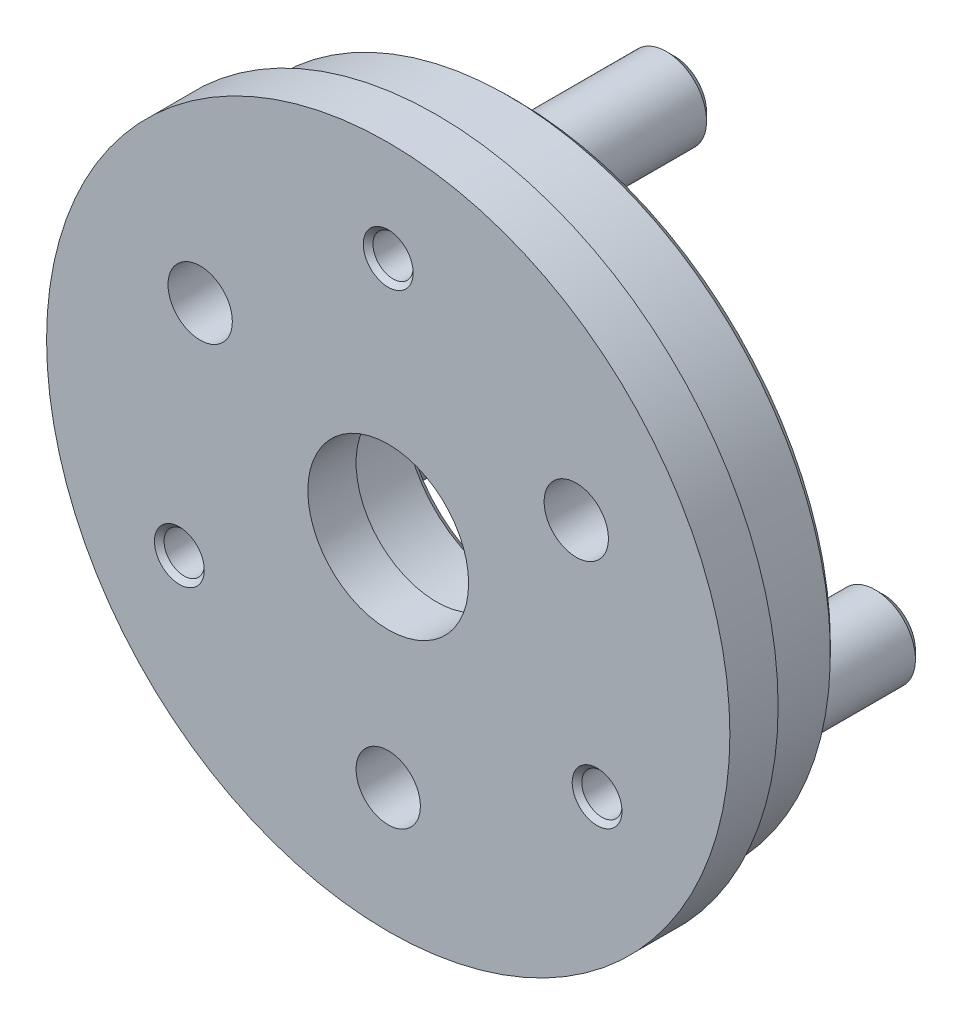
ISO-10303-21;
HEADER;
FILE_DESCRIPTION(('STEP AP214'),'2;1');
FILE_NAME('part.step','',(''),(''),'','','');
FILE_SCHEMA(('AUTOMOTIVE_DESIGN { 1 0 10303 214 1 1 1 1 }'));
ENDSEC;
DATA;
#1=APPLICATION_CONTEXT('core data for automotive mechanical design processes');
#2=APPLICATION_PROTOCOL_DEFINITION('international standard','automotive_design',2000,#1);
#3=PRODUCT_CONTEXT('',#1,'mechanical');
#4=PRODUCT('Part','Part','',(#3));
#5=PRODUCT_RELATED_PRODUCT_CATEGORY('part','',(#4));
#6=PRODUCT_DEFINITION_FORMATION('','',#4);
#7=PRODUCT_DEFINITION_CONTEXT('part definition',#1,'design');
#8=PRODUCT_DEFINITION('design','',#6,#7);
#9=PRODUCT_DEFINITION_SHAPE('','',#8);
#10=(LENGTH_UNIT() NAMED_UNIT(*) SI_UNIT(.MILLI.,.METRE.));
#11=(NAMED_UNIT(*) PLANE_ANGLE_UNIT() SI_UNIT($,.RADIAN.));
#12=(NAMED_UNIT(*) SI_UNIT($,.STERADIAN.) SOLID_ANGLE_UNIT());
#13=UNCERTAINTY_MEASURE_WITH_UNIT(LENGTH_MEASURE(1.E-05),#10,'distance_accuracy_value','');
#14=(GEOMETRIC_REPRESENTATION_CONTEXT(3) GLOBAL_UNCERTAINTY_ASSIGNED_CONTEXT((#13)) GLOBAL_UNIT_ASSIGNED_CONTEXT((#10,
#11,#12)) REPRESENTATION_CONTEXT('',''));
#15=CARTESIAN_POINT('',(0.,0.,0.));
#16=DIRECTION('',(0.,0.,1.));
#17=DIRECTION('',(1.,0.,0.));
#18=AXIS2_PLACEMENT_3D('',#15,#16,#17);
#19=CARTESIAN_POINT('',(0.,0.,-1.));
#20=DIRECTION('',(0.,0.,1.));
#21=DIRECTION('',(1.,0.,0.));
#22=AXIS2_PLACEMENT_3D('',#19,#20,#21);
#23=CYLINDRICAL_SURFACE('',#22,21.25);
#24=CARTESIAN_POINT('',(0.,0.,-2.));
#25=DIRECTION('',(0.,0.,-1.));
#26=DIRECTION('',(-1.,0.,0.));
#27=AXIS2_PLACEMENT_3D('',#24,#25,#26);
#28=CIRCLE('',#27,21.25);
#29=CARTESIAN_POINT('',(-21.25,0.,-2.));
#30=VERTEX_POINT('',#29);
#31=EDGE_CURVE('E19',#30,#30,#28,.T.);
#32=ORIENTED_EDGE('',*,*,#31,.F.);
#33=EDGE_LOOP('',(#32));
#34=FACE_BOUND('',#33,.T.);
#35=CARTESIAN_POINT('',(0.,0.,1.));
#36=DIRECTION('',(0.,0.,-1.));
#37=DIRECTION('',(-1.,0.,0.));
#38=AXIS2_PLACEMENT_3D('',#35,#36,#37);
#39=CIRCLE('',#38,21.25);
#40=CARTESIAN_POINT('',(-21.25,0.,1.));
#41=VERTEX_POINT('',#40);
#42=EDGE_CURVE('E40',#41,#41,#39,.T.);
#43=ORIENTED_EDGE('',*,*,#42,.T.);
#44=EDGE_LOOP('',(#43));
#45=FACE_BOUND('',#44,.T.);
#46=ADVANCED_FACE('F15',(#34,#45),#23,.T.);
#47=CARTESIAN_POINT('',(0.,0.,-2.));
#48=DIRECTION('',(0.,0.,-1.));
#49=DIRECTION('',(-1.,0.,0.));
#50=AXIS2_PLACEMENT_3D('',#47,#48,#49);
#51=PLANE('',#50);
#52=CARTESIAN_POINT('',(0.,0.,-2.));
#53=DIRECTION('',(0.,0.,-1.));
#54=DIRECTION('',(-1.,0.,0.));
#55=AXIS2_PLACEMENT_3D('',#52,#53,#54);
#56=CIRCLE('',#55,20.);
#57=CARTESIAN_POINT('',(-20.,0.,-2.));
#58=VERTEX_POINT('',#57);
#59=EDGE_CURVE('E31',#58,#58,#56,.T.);
#60=ORIENTED_EDGE('',*,*,#59,.F.);
#61=EDGE_LOOP('',(#60));
#62=FACE_BOUND('',#61,.T.);
#63=ORIENTED_EDGE('',*,*,#31,.T.);
#64=EDGE_LOOP('',(#63));
#65=FACE_BOUND('',#64,.T.);
#66=ADVANCED_FACE('F17',(#62,#65),#51,.T.);
#67=CARTESIAN_POINT('',(0.,0.,1.));
#68=DIRECTION('',(0.,0.,-1.));
#69=DIRECTION('',(-1.,0.,0.));
#70=AXIS2_PLACEMENT_3D('',#67,#68,#69);
#71=PLANE('',#70);
#72=CARTESIAN_POINT('',(-11.6956730781088,6.7525,1.));
#73=DIRECTION('',(0.,0.,-1.));
#74=DIRECTION('',(-1.,0.,0.));
#75=AXIS2_PLACEMENT_3D('',#72,#73,#74);
#76=CIRCLE('',#75,2.);
#77=CARTESIAN_POINT('',(-13.6956730781088,6.7525,1.));
#78=VERTEX_POINT('',#77);
#79=EDGE_CURVE('E748',#78,#78,#76,.T.);
#80=ORIENTED_EDGE('',*,*,#79,.T.);
#81=EDGE_LOOP('',(#80));
#82=FACE_BOUND('',#81,.T.);
#83=CARTESIAN_POINT('',(11.6956730781088,6.7525,1.));
#84=DIRECTION('',(0.,0.,-1.));
#85=DIRECTION('',(-1.,0.,0.));
#86=AXIS2_PLACEMENT_3D('',#83,#84,#85);
#87=CIRCLE('',#86,2.);
#88=CARTESIAN_POINT('',(9.6956730781088,6.7525,1.));
#89=VERTEX_POINT('',#88);
#90=EDGE_CURVE('E736',#89,#89,#87,.T.);
#91=ORIENTED_EDGE('',*,*,#90,.T.);
#92=EDGE_LOOP('',(#91));
#93=FACE_BOUND('',#92,.T.);
#94=CARTESIAN_POINT('',(0.,-13.505,1.));
#95=DIRECTION('',(0.,0.,-1.));
#96=DIRECTION('',(-1.,0.,0.));
#97=AXIS2_PLACEMENT_3D('',#94,#95,#96);
#98=CIRCLE('',#97,2.);
#99=CARTESIAN_POINT('',(-1.99999999999998,-13.505,1.));
#100=VERTEX_POINT('',#99);
#101=EDGE_CURVE('E725',#100,#100,#98,.T.);
#102=ORIENTED_EDGE('',*,*,#101,.T.);
#103=EDGE_LOOP('',(#102));
#104=FACE_BOUND('',#103,.T.);
#105=CARTESIAN_POINT('',(0.,15.,1.));
#106=DIRECTION('',(0.,0.,-1.));
#107=DIRECTION('',(-1.,0.,0.));
#108=AXIS2_PLACEMENT_3D('',#105,#106,#107);
#109=CIRCLE('',#108,1.55);
#110=CARTESIAN_POINT('',(-1.55,15.,1.));
#111=VERTEX_POINT('',#110);
#112=EDGE_CURVE('E78',#111,#111,#109,.T.);
#113=ORIENTED_EDGE('',*,*,#112,.T.);
#114=EDGE_LOOP('',(#113));
#115=FACE_BOUND('',#114,.T.);
#116=CARTESIAN_POINT('',(12.9903810567666,-7.5,1.));
#117=DIRECTION('',(0.,0.,-1.));
#118=DIRECTION('',(-1.,0.,0.));
#119=AXIS2_PLACEMENT_3D('',#116,#117,#118);
#120=CIRCLE('',#119,1.55);
#121=CARTESIAN_POINT('',(11.4403810567666,-7.5,1.));
#122=VERTEX_POINT('',#121);
#123=EDGE_CURVE('E75',#122,#122,#120,.T.);
#124=ORIENTED_EDGE('',*,*,#123,.T.);
#125=EDGE_LOOP('',(#124));
#126=FACE_BOUND('',#125,.T.);
#127=CARTESIAN_POINT('',(-12.9903810567666,-7.5,1.));
#128=DIRECTION('',(0.,0.,-1.));
#129=DIRECTION('',(-1.,0.,0.));
#130=AXIS2_PLACEMENT_3D('',#127,#128,#129);
#131=CIRCLE('',#130,1.55);
#132=CARTESIAN_POINT('',(-14.5403810567666,-7.5,1.));
#133=VERTEX_POINT('',#132);
#134=EDGE_CURVE('E72',#133,#133,#131,.T.);
#135=ORIENTED_EDGE('',*,*,#134,.T.);
#136=EDGE_LOOP('',(#135));
#137=FACE_BOUND('',#136,.T.);
#138=CARTESIAN_POINT('',(0.,0.,1.));
#139=DIRECTION('',(0.,0.,-1.));
#140=DIRECTION('',(-1.,0.,0.));
#141=AXIS2_PLACEMENT_3D('',#138,#139,#140);
#142=CIRCLE('',#141,5.);
#143=CARTESIAN_POINT('',(-5.,0.,1.));
#144=VERTEX_POINT('',#143);
#145=EDGE_CURVE('E44',#144,#144,#142,.T.);
#146=ORIENTED_EDGE('',*,*,#145,.T.);
#147=EDGE_LOOP('',(#146));
#148=FACE_BOUND('',#147,.T.);
#149=ORIENTED_EDGE('',*,*,#42,.F.);
#150=EDGE_LOOP('',(#149));
#151=FACE_BOUND('',#150,.T.);
#152=ADVANCED_FACE('F94',(#82,#93,#104,#115,#126,#137,#148,#151),#71,.F.);
#153=CARTESIAN_POINT('',(0.,0.,-7.));
#154=DIRECTION('',(0.,0.,1.));
#155=DIRECTION('',(1.,0.,0.));
#156=AXIS2_PLACEMENT_3D('',#153,#154,#155);
#157=CYLINDRICAL_SURFACE('',#156,20.);
#158=CARTESIAN_POINT('',(0.,0.,-6.5));
#159=DIRECTION('',(0.,0.,-1.));
#160=DIRECTION('',(-1.,0.,0.));
#161=AXIS2_PLACEMENT_3D('',#158,#159,#160);
#162=CIRCLE('',#161,20.);
#163=CARTESIAN_POINT('',(-20.,0.,-6.5));
#164=VERTEX_POINT('',#163);
#165=EDGE_CURVE('E664',#164,#164,#162,.F.);
#166=ORIENTED_EDGE('',*,*,#165,.T.);
#167=EDGE_LOOP('',(#166));
#168=FACE_BOUND('',#167,.T.);
#169=ORIENTED_EDGE('',*,*,#59,.T.);
#170=EDGE_LOOP('',(#169));
#171=FACE_BOUND('',#170,.T.);
#172=ADVANCED_FACE('F97',(#168,#171),#157,.T.);
#173=CARTESIAN_POINT('',(0.,0.,-7.));
#174=DIRECTION('',(0.,0.,-1.));
#175=DIRECTION('',(-1.,0.,0.));
#176=AXIS2_PLACEMENT_3D('',#173,#174,#175);
#177=PLANE('',#176);
#178=CARTESIAN_POINT('',(-11.6956730781088,6.7525,-7.));
#179=DIRECTION('',(0.,0.,1.));
#180=DIRECTION('',(1.,0.,0.));
#181=AXIS2_PLACEMENT_3D('',#178,#179,#180);
#182=CIRCLE('',#181,2.5);
#183=CARTESIAN_POINT('',(-9.1956730781088,6.7525,-7.));
#184=VERTEX_POINT('',#183);
#185=EDGE_CURVE('E745',#184,#184,#182,.T.);
#186=ORIENTED_EDGE('',*,*,#185,.T.);
#187=EDGE_LOOP('',(#186));
#188=FACE_BOUND('',#187,.T.);
#189=CARTESIAN_POINT('',(11.6956730781088,6.7525,-7.));
#190=DIRECTION('',(0.,0.,1.));
#191=DIRECTION('',(1.,0.,0.));
#192=AXIS2_PLACEMENT_3D('',#189,#190,#191);
#193=CIRCLE('',#192,2.5);
#194=CARTESIAN_POINT('',(14.1956730781088,6.7525,-7.));
#195=VERTEX_POINT('',#194);
#196=EDGE_CURVE('E733',#195,#195,#193,.T.);
#197=ORIENTED_EDGE('',*,*,#196,.T.);
#198=EDGE_LOOP('',(#197));
#199=FACE_BOUND('',#198,.T.);
#200=CARTESIAN_POINT('',(0.,-13.505,-7.));
#201=DIRECTION('',(0.,0.,1.));
#202=DIRECTION('',(1.,0.,0.));
#203=AXIS2_PLACEMENT_3D('',#200,#201,#202);
#204=CIRCLE('',#203,2.5);
#205=CARTESIAN_POINT('',(2.50000000000002,-13.505,-7.));
#206=VERTEX_POINT('',#205);
#207=EDGE_CURVE('E722',#206,#206,#204,.T.);
#208=ORIENTED_EDGE('',*,*,#207,.T.);
#209=EDGE_LOOP('',(#208));
#210=FACE_BOUND('',#209,.T.);
#211=CARTESIAN_POINT('',(0.,0.,-7.));
#212=DIRECTION('',(0.,0.,-1.));
#213=DIRECTION('',(-1.,0.,0.));
#214=AXIS2_PLACEMENT_3D('',#211,#212,#213);
#215=CIRCLE('',#214,19.5);
#216=CARTESIAN_POINT('',(-19.5,0.,-7.));
#217=VERTEX_POINT('',#216);
#218=EDGE_CURVE('E666',#217,#217,#215,.T.);
#219=ORIENTED_EDGE('',*,*,#218,.T.);
#220=EDGE_LOOP('',(#219));
#221=FACE_BOUND('',#220,.T.);
#222=CARTESIAN_POINT('',(0.,0.,-7.));
#223=DIRECTION('',(0.,0.,-1.));
#224=DIRECTION('',(-1.,0.,0.));
#225=AXIS2_PLACEMENT_3D('',#222,#223,#224);
#226=CIRCLE('',#225,7.);
#227=CARTESIAN_POINT('',(-7.,0.,-7.));
#228=VERTEX_POINT('',#227);
#229=EDGE_CURVE('E672',#228,#228,#226,.F.);
#230=ORIENTED_EDGE('',*,*,#229,.T.);
#231=EDGE_LOOP('',(#230));
#232=FACE_BOUND('',#231,.T.);
#233=CARTESIAN_POINT('',(12.9903810567666,-7.5,-7.));
#234=DIRECTION('',(0.,0.,-1.));
#235=DIRECTION('',(0.5,0.866025403784439,0.));
#236=AXIS2_PLACEMENT_3D('',#233,#234,#235);
#237=CIRCLE('',#236,2.5);
#238=CARTESIAN_POINT('',(14.2403810567666,-5.3349364905389,-7.));
#239=VERTEX_POINT('',#238);
#240=EDGE_CURVE('E705',#239,#239,#237,.T.);
#241=ORIENTED_EDGE('',*,*,#240,.F.);
#242=EDGE_LOOP('',(#241));
#243=FACE_BOUND('',#242,.T.);
#244=CARTESIAN_POINT('',(-12.9903810567666,-7.5,-7.));
#245=DIRECTION('',(0.,0.,-1.));
#246=DIRECTION('',(0.5,-0.866025403784437,0.));
#247=AXIS2_PLACEMENT_3D('',#244,#245,#246);
#248=CIRCLE('',#247,2.5);
#249=CARTESIAN_POINT('',(-11.7403810567666,-9.66506350946109,-7.));
#250=VERTEX_POINT('',#249);
#251=EDGE_CURVE('E37',#250,#250,#248,.T.);
#252=ORIENTED_EDGE('',*,*,#251,.F.);
#253=EDGE_LOOP('',(#252));
#254=FACE_BOUND('',#253,.T.);
#255=CARTESIAN_POINT('',(0.,15.,-7.));
#256=DIRECTION('',(0.,0.,-1.));
#257=DIRECTION('',(-1.,0.,0.));
#258=AXIS2_PLACEMENT_3D('',#255,#256,#257);
#259=CIRCLE('',#258,2.5);
#260=CARTESIAN_POINT('',(-2.5,15.,-7.));
#261=VERTEX_POINT('',#260);
#262=EDGE_CURVE('E33',#261,#261,#259,.T.);
#263=ORIENTED_EDGE('',*,*,#262,.F.);
#264=EDGE_LOOP('',(#263));
#265=FACE_BOUND('',#264,.T.);
#266=ADVANCED_FACE('F558',(#188,#199,#210,#221,#232,#243,#254,#265),#177,.T.);
#267=CARTESIAN_POINT('',(0.,15.,-16.8));
#268=DIRECTION('',(0.,0.,1.));
#269=DIRECTION('',(1.,0.,0.));
#270=AXIS2_PLACEMENT_3D('',#267,#268,#269);
#271=CYLINDRICAL_SURFACE('',#270,2.5);
#272=CARTESIAN_POINT('',(0.,15.,-16.3));
#273=DIRECTION('',(0.,0.,-1.));
#274=DIRECTION('',(-1.,0.,0.));
#275=AXIS2_PLACEMENT_3D('',#272,#273,#274);
#276=CIRCLE('',#275,2.5);
#277=CARTESIAN_POINT('',(-2.5,15.,-16.3));
#278=VERTEX_POINT('',#277);
#279=EDGE_CURVE('E57',#278,#278,#276,.F.);
#280=ORIENTED_EDGE('',*,*,#279,.T.);
#281=EDGE_LOOP('',(#280));
#282=FACE_BOUND('',#281,.T.);
#283=ORIENTED_EDGE('',*,*,#262,.T.);
#284=EDGE_LOOP('',(#283));
#285=FACE_BOUND('',#284,.T.);
#286=ADVANCED_FACE('F547',(#282,#285),#271,.T.);
#287=CARTESIAN_POINT('',(0.,15.,-16.8));
#288=DIRECTION('',(0.,0.,-1.));
#289=DIRECTION('',(-1.,0.,0.));
#290=AXIS2_PLACEMENT_3D('',#287,#288,#289);
#291=PLANE('',#290);
#292=CARTESIAN_POINT('',(0.,15.,-16.8));
#293=DIRECTION('',(0.,0.,-1.));
#294=DIRECTION('',(-1.,0.,0.));
#295=AXIS2_PLACEMENT_3D('',#292,#293,#294);
#296=CIRCLE('',#295,1.55);
#297=CARTESIAN_POINT('',(-1.55,15.,-16.8));
#298=VERTEX_POINT('',#297);
#299=EDGE_CURVE('E66',#298,#298,#296,.F.);
#300=ORIENTED_EDGE('',*,*,#299,.T.);
#301=EDGE_LOOP('',(#300));
#302=FACE_BOUND('',#301,.T.);
#303=CARTESIAN_POINT('',(0.,15.,-16.8));
#304=DIRECTION('',(0.,0.,-1.));
#305=DIRECTION('',(-1.,0.,0.));
#306=AXIS2_PLACEMENT_3D('',#303,#304,#305);
#307=CIRCLE('',#306,2.);
#308=CARTESIAN_POINT('',(-2.,15.,-16.8));
#309=VERTEX_POINT('',#308);
#310=EDGE_CURVE('E687',#309,#309,#307,.T.);
#311=ORIENTED_EDGE('',*,*,#310,.T.);
#312=EDGE_LOOP('',(#311));
#313=FACE_BOUND('',#312,.T.);
#314=ADVANCED_FACE('F535',(#302,#313),#291,.T.);
#315=CARTESIAN_POINT('',(-12.9903810567666,-7.5,-16.8));
#316=DIRECTION('',(0.,0.,1.));
#317=DIRECTION('',(1.,0.,0.));
#318=AXIS2_PLACEMENT_3D('',#315,#316,#317);
#319=CYLINDRICAL_SURFACE('',#318,2.5);
#320=CARTESIAN_POINT('',(-12.9903810567666,-7.5,-16.3));
#321=DIRECTION('',(0.,0.,-1.));
#322=DIRECTION('',(-1.,0.,0.));
#323=AXIS2_PLACEMENT_3D('',#320,#321,#322);
#324=CIRCLE('',#323,2.5);
#325=CARTESIAN_POINT('',(-15.4903810567666,-7.5,-16.3));
#326=VERTEX_POINT('',#325);
#327=EDGE_CURVE('E684',#326,#326,#324,.F.);
#328=ORIENTED_EDGE('',*,*,#327,.T.);
#329=EDGE_LOOP('',(#328));
#330=FACE_BOUND('',#329,.T.);
#331=ORIENTED_EDGE('',*,*,#251,.T.);
#332=EDGE_LOOP('',(#331));
#333=FACE_BOUND('',#332,.T.);
#334=ADVANCED_FACE('F522',(#330,#333),#319,.T.);
#335=CARTESIAN_POINT('',(-12.9903810567666,-7.5,-16.8));
#336=DIRECTION('',(0.,0.,-1.));
#337=DIRECTION('',(-1.,0.,0.));
#338=AXIS2_PLACEMENT_3D('',#335,#336,#337);
#339=PLANE('',#338);
#340=CARTESIAN_POINT('',(-12.9903810567666,-7.5,-16.8));
#341=DIRECTION('',(0.,0.,-1.));
#342=DIRECTION('',(-1.,0.,0.));
#343=AXIS2_PLACEMENT_3D('',#340,#341,#342);
#344=CIRCLE('',#343,1.55);
#345=CARTESIAN_POINT('',(-14.5403810567666,-7.5,-16.8));
#346=VERTEX_POINT('',#345);
#347=EDGE_CURVE('E60',#346,#346,#344,.F.);
#348=ORIENTED_EDGE('',*,*,#347,.T.);
#349=EDGE_LOOP('',(#348));
#350=FACE_BOUND('',#349,.T.);
#351=CARTESIAN_POINT('',(-12.9903810567666,-7.5,-16.8));
#352=DIRECTION('',(0.,0.,-1.));
#353=DIRECTION('',(-1.,0.,0.));
#354=AXIS2_PLACEMENT_3D('',#351,#352,#353);
#355=CIRCLE('',#354,2.);
#356=CARTESIAN_POINT('',(-14.9903810567666,-7.5,-16.8));
#357=VERTEX_POINT('',#356);
#358=EDGE_CURVE('E681',#357,#357,#355,.T.);
#359=ORIENTED_EDGE('',*,*,#358,.T.);
#360=EDGE_LOOP('',(#359));
#361=FACE_BOUND('',#360,.T.);
#362=ADVANCED_FACE('F509',(#350,#361),#339,.T.);
#363=CARTESIAN_POINT('',(12.9903810567666,-7.5,-16.8));
#364=DIRECTION('',(0.,0.,1.));
#365=DIRECTION('',(1.,0.,0.));
#366=AXIS2_PLACEMENT_3D('',#363,#364,#365);
#367=CYLINDRICAL_SURFACE('',#366,2.5);
#368=CARTESIAN_POINT('',(12.9903810567666,-7.5,-16.3));
#369=DIRECTION('',(0.,0.,-1.));
#370=DIRECTION('',(-1.,0.,0.));
#371=AXIS2_PLACEMENT_3D('',#368,#369,#370);
#372=CIRCLE('',#371,2.5);
#373=CARTESIAN_POINT('',(10.4903810567666,-7.5,-16.3));
#374=VERTEX_POINT('',#373);
#375=EDGE_CURVE('E678',#374,#374,#372,.F.);
#376=ORIENTED_EDGE('',*,*,#375,.T.);
#377=EDGE_LOOP('',(#376));
#378=FACE_BOUND('',#377,.T.);
#379=ORIENTED_EDGE('',*,*,#240,.T.);
#380=EDGE_LOOP('',(#379));
#381=FACE_BOUND('',#380,.T.);
#382=ADVANCED_FACE('F121',(#378,#381),#367,.T.);
#383=CARTESIAN_POINT('',(12.9903810567666,-7.5,-16.8));
#384=DIRECTION('',(0.,0.,-1.));
#385=DIRECTION('',(-1.,0.,0.));
#386=AXIS2_PLACEMENT_3D('',#383,#384,#385);
#387=PLANE('',#386);
#388=CARTESIAN_POINT('',(12.9903810567666,-7.5,-16.8));
#389=DIRECTION('',(0.,0.,-1.));
#390=DIRECTION('',(-1.,0.,0.));
#391=AXIS2_PLACEMENT_3D('',#388,#389,#390);
#392=CIRCLE('',#391,1.55);
#393=CARTESIAN_POINT('',(11.4403810567666,-7.5,-16.8));
#394=VERTEX_POINT('',#393);
#395=EDGE_CURVE('E53',#394,#394,#392,.F.);
#396=ORIENTED_EDGE('',*,*,#395,.T.);
#397=EDGE_LOOP('',(#396));
#398=FACE_BOUND('',#397,.T.);
#399=CARTESIAN_POINT('',(12.9903810567666,-7.5,-16.8));
#400=DIRECTION('',(0.,0.,-1.));
#401=DIRECTION('',(-1.,0.,0.));
#402=AXIS2_PLACEMENT_3D('',#399,#400,#401);
#403=CIRCLE('',#402,2.);
#404=CARTESIAN_POINT('',(10.9903810567666,-7.5,-16.8));
#405=VERTEX_POINT('',#404);
#406=EDGE_CURVE('E669',#405,#405,#403,.T.);
#407=ORIENTED_EDGE('',*,*,#406,.T.);
#408=EDGE_LOOP('',(#407));
#409=FACE_BOUND('',#408,.T.);
#410=ADVANCED_FACE('F110',(#398,#409),#387,.T.);
#411=CARTESIAN_POINT('',(0.,0.,43.));
#412=DIRECTION('',(0.,0.,1.));
#413=DIRECTION('',(1.,0.,0.));
#414=AXIS2_PLACEMENT_3D('',#411,#412,#413);
#415=CYLINDRICAL_SURFACE('',#414,5.);
#416=CARTESIAN_POINT('',(0.,0.,-2.));
#417=DIRECTION('',(0.,0.,1.));
#418=DIRECTION('',(1.,0.,0.));
#419=AXIS2_PLACEMENT_3D('',#416,#417,#418);
#420=CIRCLE('',#419,5.);
#421=CARTESIAN_POINT('',(5.,0.,-2.));
#422=VERTEX_POINT('',#421);
#423=EDGE_CURVE('E49',#422,#422,#420,.F.);
#424=ORIENTED_EDGE('',*,*,#423,.T.);
#425=EDGE_LOOP('',(#424));
#426=FACE_BOUND('',#425,.T.);
#427=ORIENTED_EDGE('',*,*,#145,.F.);
#428=EDGE_LOOP('',(#427));
#429=FACE_BOUND('',#428,.T.);
#430=ADVANCED_FACE('F107',(#426,#429),#415,.F.);
#431=CARTESIAN_POINT('',(0.,0.,-2.));
#432=DIRECTION('',(0.,0.,1.));
#433=DIRECTION('',(1.,0.,0.));
#434=AXIS2_PLACEMENT_3D('',#431,#432,#433);
#435=PLANE('',#434);
#436=ORIENTED_EDGE('',*,*,#423,.F.);
#437=EDGE_LOOP('',(#436));
#438=FACE_BOUND('',#437,.T.);
#439=CARTESIAN_POINT('',(0.,0.,-2.));
#440=DIRECTION('',(0.,0.,1.));
#441=DIRECTION('',(1.,0.,0.));
#442=AXIS2_PLACEMENT_3D('',#439,#440,#441);
#443=CIRCLE('',#442,6.5);
#444=CARTESIAN_POINT('',(6.5,0.,-2.));
#445=VERTEX_POINT('',#444);
#446=EDGE_CURVE('E718',#445,#445,#443,.F.);
#447=ORIENTED_EDGE('',*,*,#446,.T.);
#448=EDGE_LOOP('',(#447));
#449=FACE_BOUND('',#448,.T.);
#450=ADVANCED_FACE('F109',(#438,#449),#435,.F.);
#451=CARTESIAN_POINT('',(0.,0.,-7.));
#452=DIRECTION('',(0.,0.,1.));
#453=DIRECTION('',(1.,0.,0.));
#454=AXIS2_PLACEMENT_3D('',#451,#452,#453);
#455=CYLINDRICAL_SURFACE('',#454,6.5);
#456=CARTESIAN_POINT('',(0.,0.,-6.5));
#457=DIRECTION('',(0.,0.,-1.));
#458=DIRECTION('',(-1.,0.,0.));
#459=AXIS2_PLACEMENT_3D('',#456,#457,#458);
#460=CIRCLE('',#459,6.5);
#461=CARTESIAN_POINT('',(-6.5,0.,-6.5));
#462=VERTEX_POINT('',#461);
#463=EDGE_CURVE('E665',#462,#462,#460,.T.);
#464=ORIENTED_EDGE('',*,*,#463,.T.);
#465=EDGE_LOOP('',(#464));
#466=FACE_BOUND('',#465,.T.);
#467=ORIENTED_EDGE('',*,*,#446,.F.);
#468=EDGE_LOOP('',(#467));
#469=FACE_BOUND('',#468,.T.);
#470=ADVANCED_FACE('F118',(#466,#469),#455,.F.);
#471=CARTESIAN_POINT('',(0.,0.,-7.));
#472=DIRECTION('',(0.,0.,1.));
#473=DIRECTION('',(1.,0.,0.));
#474=AXIS2_PLACEMENT_3D('',#471,#472,#473);
#475=CONICAL_SURFACE('',#474,19.5,0.785398163397449);
#476=ORIENTED_EDGE('',*,*,#165,.F.);
#477=EDGE_LOOP('',(#476));
#478=FACE_BOUND('',#477,.T.);
#479=ORIENTED_EDGE('',*,*,#218,.F.);
#480=EDGE_LOOP('',(#479));
#481=FACE_BOUND('',#480,.T.);
#482=ADVANCED_FACE('F136',(#478,#481),#475,.T.);
#483=CARTESIAN_POINT('',(0.,0.,-7.));
#484=DIRECTION('',(0.,0.,-1.));
#485=DIRECTION('',(-1.,0.,0.));
#486=AXIS2_PLACEMENT_3D('',#483,#484,#485);
#487=CONICAL_SURFACE('',#486,7.,0.785398163397449);
#488=ORIENTED_EDGE('',*,*,#463,.F.);
#489=EDGE_LOOP('',(#488));
#490=FACE_BOUND('',#489,.T.);
#491=ORIENTED_EDGE('',*,*,#229,.F.);
#492=EDGE_LOOP('',(#491));
#493=FACE_BOUND('',#492,.T.);
#494=ADVANCED_FACE('F139',(#490,#493),#487,.F.);
#495=CARTESIAN_POINT('',(12.9903810567666,-7.5,-16.8));
#496=DIRECTION('',(0.,0.,1.));
#497=DIRECTION('',(1.,0.,0.));
#498=AXIS2_PLACEMENT_3D('',#495,#496,#497);
#499=CONICAL_SURFACE('',#498,2.,0.785398163397449);
#500=ORIENTED_EDGE('',*,*,#375,.F.);
#501=EDGE_LOOP('',(#500));
#502=FACE_BOUND('',#501,.T.);
#503=ORIENTED_EDGE('',*,*,#406,.F.);
#504=EDGE_LOOP('',(#503));
#505=FACE_BOUND('',#504,.T.);
#506=ADVANCED_FACE('F143',(#502,#505),#499,.T.);
#507=CARTESIAN_POINT('',(-12.9903810567666,-7.5,-16.8));
#508=DIRECTION('',(0.,0.,1.));
#509=DIRECTION('',(1.,0.,0.));
#510=AXIS2_PLACEMENT_3D('',#507,#508,#509);
#511=CONICAL_SURFACE('',#510,2.,0.785398163397448);
#512=ORIENTED_EDGE('',*,*,#327,.F.);
#513=EDGE_LOOP('',(#512));
#514=FACE_BOUND('',#513,.T.);
#515=ORIENTED_EDGE('',*,*,#358,.F.);
#516=EDGE_LOOP('',(#515));
#517=FACE_BOUND('',#516,.T.);
#518=ADVANCED_FACE('F147',(#514,#517),#511,.T.);
#519=CARTESIAN_POINT('',(0.,15.,-16.8));
#520=DIRECTION('',(0.,0.,1.));
#521=DIRECTION('',(1.,0.,0.));
#522=AXIS2_PLACEMENT_3D('',#519,#520,#521);
#523=CONICAL_SURFACE('',#522,2.,0.785398163397448);
#524=ORIENTED_EDGE('',*,*,#279,.F.);
#525=EDGE_LOOP('',(#524));
#526=FACE_BOUND('',#525,.T.);
#527=ORIENTED_EDGE('',*,*,#310,.F.);
#528=EDGE_LOOP('',(#527));
#529=FACE_BOUND('',#528,.T.);
#530=ADVANCED_FACE('F151',(#526,#529),#523,.T.);
#531=CARTESIAN_POINT('',(0.,15.,-16.8));
#532=DIRECTION('',(0.,0.,1.));
#533=DIRECTION('',(1.,0.,0.));
#534=AXIS2_PLACEMENT_3D('',#531,#532,#533);
#535=CYLINDRICAL_SURFACE('',#534,1.25);
#536=CARTESIAN_POINT('',(0.,15.,0.7));
#537=DIRECTION('',(0.,0.,-1.));
#538=DIRECTION('',(-1.,0.,0.));
#539=AXIS2_PLACEMENT_3D('',#536,#537,#538);
#540=CIRCLE('',#539,1.25);
#541=CARTESIAN_POINT('',(-1.25,15.,0.7));
#542=VERTEX_POINT('',#541);
#543=EDGE_CURVE('E28',#542,#542,#540,.F.);
#544=ORIENTED_EDGE('',*,*,#543,.T.);
#545=EDGE_LOOP('',(#544));
#546=FACE_BOUND('',#545,.T.);
#547=CARTESIAN_POINT('',(0.,15.,-16.5));
#548=DIRECTION('',(0.,0.,-1.));
#549=DIRECTION('',(-1.,0.,0.));
#550=AXIS2_PLACEMENT_3D('',#547,#548,#549);
#551=CIRCLE('',#550,1.25);
#552=CARTESIAN_POINT('',(-1.25,15.,-16.5));
#553=VERTEX_POINT('',#552);
#554=EDGE_CURVE('E69',#553,#553,#551,.T.);
#555=ORIENTED_EDGE('',*,*,#554,.T.);
#556=EDGE_LOOP('',(#555));
#557=FACE_BOUND('',#556,.T.);
#558=ADVANCED_FACE('F83',(#546,#557),#535,.F.);
#559=CARTESIAN_POINT('',(-12.9903810567666,-7.5,-16.8));
#560=DIRECTION('',(0.,0.,1.));
#561=DIRECTION('',(1.,0.,0.));
#562=AXIS2_PLACEMENT_3D('',#559,#560,#561);
#563=CYLINDRICAL_SURFACE('',#562,1.25);
#564=CARTESIAN_POINT('',(-12.9903810567666,-7.5,0.7));
#565=DIRECTION('',(0.,0.,-1.));
#566=DIRECTION('',(-1.,0.,0.));
#567=AXIS2_PLACEMENT_3D('',#564,#565,#566);
#568=CIRCLE('',#567,1.25);
#569=CARTESIAN_POINT('',(-14.2403810567666,-7.5,0.7));
#570=VERTEX_POINT('',#569);
#571=EDGE_CURVE('E10',#570,#570,#568,.F.);
#572=ORIENTED_EDGE('',*,*,#571,.T.);
#573=EDGE_LOOP('',(#572));
#574=FACE_BOUND('',#573,.T.);
#575=CARTESIAN_POINT('',(-12.9903810567666,-7.5,-16.5));
#576=DIRECTION('',(0.,0.,-1.));
#577=DIRECTION('',(-1.,0.,0.));
#578=AXIS2_PLACEMENT_3D('',#575,#576,#577);
#579=CIRCLE('',#578,1.25);
#580=CARTESIAN_POINT('',(-14.2403810567666,-7.5,-16.5));
#581=VERTEX_POINT('',#580);
#582=EDGE_CURVE('E63',#581,#581,#579,.T.);
#583=ORIENTED_EDGE('',*,*,#582,.T.);
#584=EDGE_LOOP('',(#583));
#585=FACE_BOUND('',#584,.T.);
#586=ADVANCED_FACE('F194',(#574,#585),#563,.F.);
#587=CARTESIAN_POINT('',(12.9903810567666,-7.5,-16.8));
#588=DIRECTION('',(0.,0.,1.));
#589=DIRECTION('',(1.,0.,0.));
#590=AXIS2_PLACEMENT_3D('',#587,#588,#589);
#591=CYLINDRICAL_SURFACE('',#590,1.25);
#592=CARTESIAN_POINT('',(12.9903810567666,-7.5,0.7));
#593=DIRECTION('',(0.,0.,-1.));
#594=DIRECTION('',(-1.,0.,0.));
#595=AXIS2_PLACEMENT_3D('',#592,#593,#594);
#596=CIRCLE('',#595,1.25);
#597=CARTESIAN_POINT('',(11.7403810567666,-7.5,0.7));
#598=VERTEX_POINT('',#597);
#599=EDGE_CURVE('E23',#598,#598,#596,.F.);
#600=ORIENTED_EDGE('',*,*,#599,.T.);
#601=EDGE_LOOP('',(#600));
#602=FACE_BOUND('',#601,.T.);
#603=CARTESIAN_POINT('',(12.9903810567666,-7.5,-16.5));
#604=DIRECTION('',(0.,0.,-1.));
#605=DIRECTION('',(-1.,0.,0.));
#606=AXIS2_PLACEMENT_3D('',#603,#604,#605);
#607=CIRCLE('',#606,1.25);
#608=CARTESIAN_POINT('',(11.7403810567666,-7.5,-16.5));
#609=VERTEX_POINT('',#608);
#610=EDGE_CURVE('E56',#609,#609,#607,.T.);
#611=ORIENTED_EDGE('',*,*,#610,.T.);
#612=EDGE_LOOP('',(#611));
#613=FACE_BOUND('',#612,.T.);
#614=ADVANCED_FACE('F160',(#602,#613),#591,.F.);
#615=CARTESIAN_POINT('',(12.9903810567666,-7.5,-16.8));
#616=DIRECTION('',(0.,0.,-1.));
#617=DIRECTION('',(-1.,0.,0.));
#618=AXIS2_PLACEMENT_3D('',#615,#616,#617);
#619=CONICAL_SURFACE('',#618,1.55,0.785398163397445);
#620=ORIENTED_EDGE('',*,*,#610,.F.);
#621=EDGE_LOOP('',(#620));
#622=FACE_BOUND('',#621,.T.);
#623=ORIENTED_EDGE('',*,*,#395,.F.);
#624=EDGE_LOOP('',(#623));
#625=FACE_BOUND('',#624,.T.);
#626=ADVANCED_FACE('F156',(#622,#625),#619,.F.);
#627=CARTESIAN_POINT('',(-12.9903810567666,-7.5,-16.8));
#628=DIRECTION('',(0.,0.,-1.));
#629=DIRECTION('',(-1.,0.,0.));
#630=AXIS2_PLACEMENT_3D('',#627,#628,#629);
#631=CONICAL_SURFACE('',#630,1.55,0.785398163397445);
#632=ORIENTED_EDGE('',*,*,#582,.F.);
#633=EDGE_LOOP('',(#632));
#634=FACE_BOUND('',#633,.T.);
#635=ORIENTED_EDGE('',*,*,#347,.F.);
#636=EDGE_LOOP('',(#635));
#637=FACE_BOUND('',#636,.T.);
#638=ADVANCED_FACE('F159',(#634,#637),#631,.F.);
#639=CARTESIAN_POINT('',(0.,15.,-16.8));
#640=DIRECTION('',(0.,0.,-1.));
#641=DIRECTION('',(-1.,0.,0.));
#642=AXIS2_PLACEMENT_3D('',#639,#640,#641);
#643=CONICAL_SURFACE('',#642,1.55,0.785398163397446);
#644=ORIENTED_EDGE('',*,*,#554,.F.);
#645=EDGE_LOOP('',(#644));
#646=FACE_BOUND('',#645,.T.);
#647=ORIENTED_EDGE('',*,*,#299,.F.);
#648=EDGE_LOOP('',(#647));
#649=FACE_BOUND('',#648,.T.);
#650=ADVANCED_FACE('F90',(#646,#649),#643,.F.);
#651=CARTESIAN_POINT('',(0.,15.,1.));
#652=DIRECTION('',(0.,0.,1.));
#653=DIRECTION('',(1.,0.,0.));
#654=AXIS2_PLACEMENT_3D('',#651,#652,#653);
#655=CONICAL_SURFACE('',#654,1.55,0.785398163397446);
#656=ORIENTED_EDGE('',*,*,#543,.F.);
#657=EDGE_LOOP('',(#656));
#658=FACE_BOUND('',#657,.T.);
#659=ORIENTED_EDGE('',*,*,#112,.F.);
#660=EDGE_LOOP('',(#659));
#661=FACE_BOUND('',#660,.T.);
#662=ADVANCED_FACE('F86',(#658,#661),#655,.F.);
#663=CARTESIAN_POINT('',(12.9903810567666,-7.5,1.));
#664=DIRECTION('',(0.,0.,1.));
#665=DIRECTION('',(1.,0.,0.));
#666=AXIS2_PLACEMENT_3D('',#663,#664,#665);
#667=CONICAL_SURFACE('',#666,1.55,0.785398163397445);
#668=ORIENTED_EDGE('',*,*,#599,.F.);
#669=EDGE_LOOP('',(#668));
#670=FACE_BOUND('',#669,.T.);
#671=ORIENTED_EDGE('',*,*,#123,.F.);
#672=EDGE_LOOP('',(#671));
#673=FACE_BOUND('',#672,.T.);
#674=ADVANCED_FACE('F89',(#670,#673),#667,.F.);
#675=CARTESIAN_POINT('',(-12.9903810567666,-7.5,1.));
#676=DIRECTION('',(0.,0.,1.));
#677=DIRECTION('',(1.,0.,0.));
#678=AXIS2_PLACEMENT_3D('',#675,#676,#677);
#679=CONICAL_SURFACE('',#678,1.55,0.785398163397445);
#680=ORIENTED_EDGE('',*,*,#571,.F.);
#681=EDGE_LOOP('',(#680));
#682=FACE_BOUND('',#681,.T.);
#683=ORIENTED_EDGE('',*,*,#134,.F.);
#684=EDGE_LOOP('',(#683));
#685=FACE_BOUND('',#684,.T.);
#686=ADVANCED_FACE('F169',(#682,#685),#679,.F.);
#687=CARTESIAN_POINT('',(0.,-13.505,-6.));
#688=DIRECTION('',(0.,0.,1.));
#689=DIRECTION('',(1.,0.,0.));
#690=AXIS2_PLACEMENT_3D('',#687,#688,#689);
#691=PLANE('',#690);
#692=CARTESIAN_POINT('',(0.,-13.505,-6.));
#693=DIRECTION('',(0.,0.,1.));
#694=DIRECTION('',(1.,0.,0.));
#695=AXIS2_PLACEMENT_3D('',#692,#693,#694);
#696=CIRCLE('',#695,2.);
#697=CARTESIAN_POINT('',(2.00000000000002,-13.505,-6.));
#698=VERTEX_POINT('',#697);
#699=EDGE_CURVE('E730',#698,#698,#696,.T.);
#700=ORIENTED_EDGE('',*,*,#699,.T.);
#701=EDGE_LOOP('',(#700));
#702=FACE_BOUND('',#701,.T.);
#703=CARTESIAN_POINT('',(0.,-13.505,-6.));
#704=DIRECTION('',(0.,0.,1.));
#705=DIRECTION('',(1.,0.,0.));
#706=AXIS2_PLACEMENT_3D('',#703,#704,#705);
#707=CIRCLE('',#706,2.5);
#708=CARTESIAN_POINT('',(2.50000000000002,-13.505,-6.));
#709=VERTEX_POINT('',#708);
#710=EDGE_CURVE('E721',#709,#709,#707,.F.);
#711=ORIENTED_EDGE('',*,*,#710,.T.);
#712=EDGE_LOOP('',(#711));
#713=FACE_BOUND('',#712,.T.);
#714=ADVANCED_FACE('F172',(#702,#713),#691,.F.);
#715=CARTESIAN_POINT('',(0.,-13.505,-7.));
#716=DIRECTION('',(0.,0.,1.));
#717=DIRECTION('',(1.,0.,0.));
#718=AXIS2_PLACEMENT_3D('',#715,#716,#717);
#719=CYLINDRICAL_SURFACE('',#718,2.5);
#720=ORIENTED_EDGE('',*,*,#710,.F.);
#721=EDGE_LOOP('',(#720));
#722=FACE_BOUND('',#721,.T.);
#723=ORIENTED_EDGE('',*,*,#207,.F.);
#724=EDGE_LOOP('',(#723));
#725=FACE_BOUND('',#724,.T.);
#726=ADVANCED_FACE('F177',(#722,#725),#719,.F.);
#727=CARTESIAN_POINT('',(0.,-13.505,-6.));
#728=DIRECTION('',(0.,0.,1.));
#729=DIRECTION('',(1.,0.,0.));
#730=AXIS2_PLACEMENT_3D('',#727,#728,#729);
#731=CYLINDRICAL_SURFACE('',#730,2.);
#732=ORIENTED_EDGE('',*,*,#699,.F.);
#733=EDGE_LOOP('',(#732));
#734=FACE_BOUND('',#733,.T.);
#735=ORIENTED_EDGE('',*,*,#101,.F.);
#736=EDGE_LOOP('',(#735));
#737=FACE_BOUND('',#736,.T.);
#738=ADVANCED_FACE('F184',(#734,#737),#731,.F.);
#739=CARTESIAN_POINT('',(11.6956730781088,6.7525,-6.));
#740=DIRECTION('',(0.,0.,1.));
#741=DIRECTION('',(1.,0.,0.));
#742=AXIS2_PLACEMENT_3D('',#739,#740,#741);
#743=PLANE('',#742);
#744=CARTESIAN_POINT('',(11.6956730781088,6.7525,-6.));
#745=DIRECTION('',(0.,0.,1.));
#746=DIRECTION('',(1.,0.,0.));
#747=AXIS2_PLACEMENT_3D('',#744,#745,#746);
#748=CIRCLE('',#747,2.);
#749=CARTESIAN_POINT('',(13.6956730781088,6.7525,-6.));
#750=VERTEX_POINT('',#749);
#751=EDGE_CURVE('E741',#750,#750,#748,.T.);
#752=ORIENTED_EDGE('',*,*,#751,.T.);
#753=EDGE_LOOP('',(#752));
#754=FACE_BOUND('',#753,.T.);
#755=CARTESIAN_POINT('',(11.6956730781088,6.7525,-6.));
#756=DIRECTION('',(0.,0.,1.));
#757=DIRECTION('',(1.,0.,0.));
#758=AXIS2_PLACEMENT_3D('',#755,#756,#757);
#759=CIRCLE('',#758,2.5);
#760=CARTESIAN_POINT('',(14.1956730781088,6.7525,-6.));
#761=VERTEX_POINT('',#760);
#762=EDGE_CURVE('E732',#761,#761,#759,.F.);
#763=ORIENTED_EDGE('',*,*,#762,.T.);
#764=EDGE_LOOP('',(#763));
#765=FACE_BOUND('',#764,.T.);
#766=ADVANCED_FACE('F271',(#754,#765),#743,.F.);
#767=CARTESIAN_POINT('',(11.6956730781088,6.7525,-7.));
#768=DIRECTION('',(0.,0.,1.));
#769=DIRECTION('',(1.,0.,0.));
#770=AXIS2_PLACEMENT_3D('',#767,#768,#769);
#771=CYLINDRICAL_SURFACE('',#770,2.5);
#772=ORIENTED_EDGE('',*,*,#762,.F.);
#773=EDGE_LOOP('',(#772));
#774=FACE_BOUND('',#773,.T.);
#775=ORIENTED_EDGE('',*,*,#196,.F.);
#776=EDGE_LOOP('',(#775));
#777=FACE_BOUND('',#776,.T.);
#778=ADVANCED_FACE('F281',(#774,#777),#771,.F.);
#779=CARTESIAN_POINT('',(11.6956730781088,6.7525,-6.));
#780=DIRECTION('',(0.,0.,1.));
#781=DIRECTION('',(1.,0.,0.));
#782=AXIS2_PLACEMENT_3D('',#779,#780,#781);
#783=CYLINDRICAL_SURFACE('',#782,2.);
#784=ORIENTED_EDGE('',*,*,#751,.F.);
#785=EDGE_LOOP('',(#784));
#786=FACE_BOUND('',#785,.T.);
#787=ORIENTED_EDGE('',*,*,#90,.F.);
#788=EDGE_LOOP('',(#787));
#789=FACE_BOUND('',#788,.T.);
#790=ADVANCED_FACE('F292',(#786,#789),#783,.F.);
#791=CARTESIAN_POINT('',(-11.6956730781088,6.7525,-6.));
#792=DIRECTION('',(0.,0.,1.));
#793=DIRECTION('',(1.,0.,0.));
#794=AXIS2_PLACEMENT_3D('',#791,#792,#793);
#795=PLANE('',#794);
#796=CARTESIAN_POINT('',(-11.6956730781088,6.7525,-6.));
#797=DIRECTION('',(0.,0.,1.));
#798=DIRECTION('',(1.,0.,0.));
#799=AXIS2_PLACEMENT_3D('',#796,#797,#798);
#800=CIRCLE('',#799,2.);
#801=CARTESIAN_POINT('',(-9.6956730781088,6.7525,-6.));
#802=VERTEX_POINT('',#801);
#803=EDGE_CURVE('E753',#802,#802,#800,.T.);
#804=ORIENTED_EDGE('',*,*,#803,.T.);
#805=EDGE_LOOP('',(#804));
#806=FACE_BOUND('',#805,.T.);
#807=CARTESIAN_POINT('',(-11.6956730781088,6.7525,-6.));
#808=DIRECTION('',(0.,0.,1.));
#809=DIRECTION('',(1.,0.,0.));
#810=AXIS2_PLACEMENT_3D('',#807,#808,#809);
#811=CIRCLE('',#810,2.5);
#812=CARTESIAN_POINT('',(-9.1956730781088,6.7525,-6.));
#813=VERTEX_POINT('',#812);
#814=EDGE_CURVE('E744',#813,#813,#811,.F.);
#815=ORIENTED_EDGE('',*,*,#814,.T.);
#816=EDGE_LOOP('',(#815));
#817=FACE_BOUND('',#816,.T.);
#818=ADVANCED_FACE('F302',(#806,#817),#795,.F.);
#819=CARTESIAN_POINT('',(-11.6956730781088,6.7525,-7.));
#820=DIRECTION('',(0.,0.,1.));
#821=DIRECTION('',(1.,0.,0.));
#822=AXIS2_PLACEMENT_3D('',#819,#820,#821);
#823=CYLINDRICAL_SURFACE('',#822,2.5);
#824=ORIENTED_EDGE('',*,*,#814,.F.);
#825=EDGE_LOOP('',(#824));
#826=FACE_BOUND('',#825,.T.);
#827=ORIENTED_EDGE('',*,*,#185,.F.);
#828=EDGE_LOOP('',(#827));
#829=FACE_BOUND('',#828,.T.);
#830=ADVANCED_FACE('F313',(#826,#829),#823,.F.);
#831=CARTESIAN_POINT('',(-11.6956730781088,6.7525,-6.));
#832=DIRECTION('',(0.,0.,1.));
#833=DIRECTION('',(1.,0.,0.));
#834=AXIS2_PLACEMENT_3D('',#831,#832,#833);
#835=CYLINDRICAL_SURFACE('',#834,2.);
#836=ORIENTED_EDGE('',*,*,#803,.F.);
#837=EDGE_LOOP('',(#836));
#838=FACE_BOUND('',#837,.T.);
#839=ORIENTED_EDGE('',*,*,#79,.F.);
#840=EDGE_LOOP('',(#839));
#841=FACE_BOUND('',#840,.T.);
#842=ADVANCED_FACE('F324',(#838,#841),#835,.F.);
#843=CLOSED_SHELL('',(#46,#66,#152,#172,#266,#286,#314,#334,#362,#382,#410,#430,#450,#470,#482,
#494,#506,#518,#530,#558,#586,#614,#626,#638,#650,#662,#674,#686,#714,#726,#738,#766,#778,#790,
#818,#830,#842));
#844=MANIFOLD_SOLID_BREP('B1',#843);
#845=ADVANCED_BREP_SHAPE_REPRESENTATION('',(#18,#844),#14);
#846=SHAPE_DEFINITION_REPRESENTATION(#9,#845);
ENDSEC;
END-ISO-10303-21;
